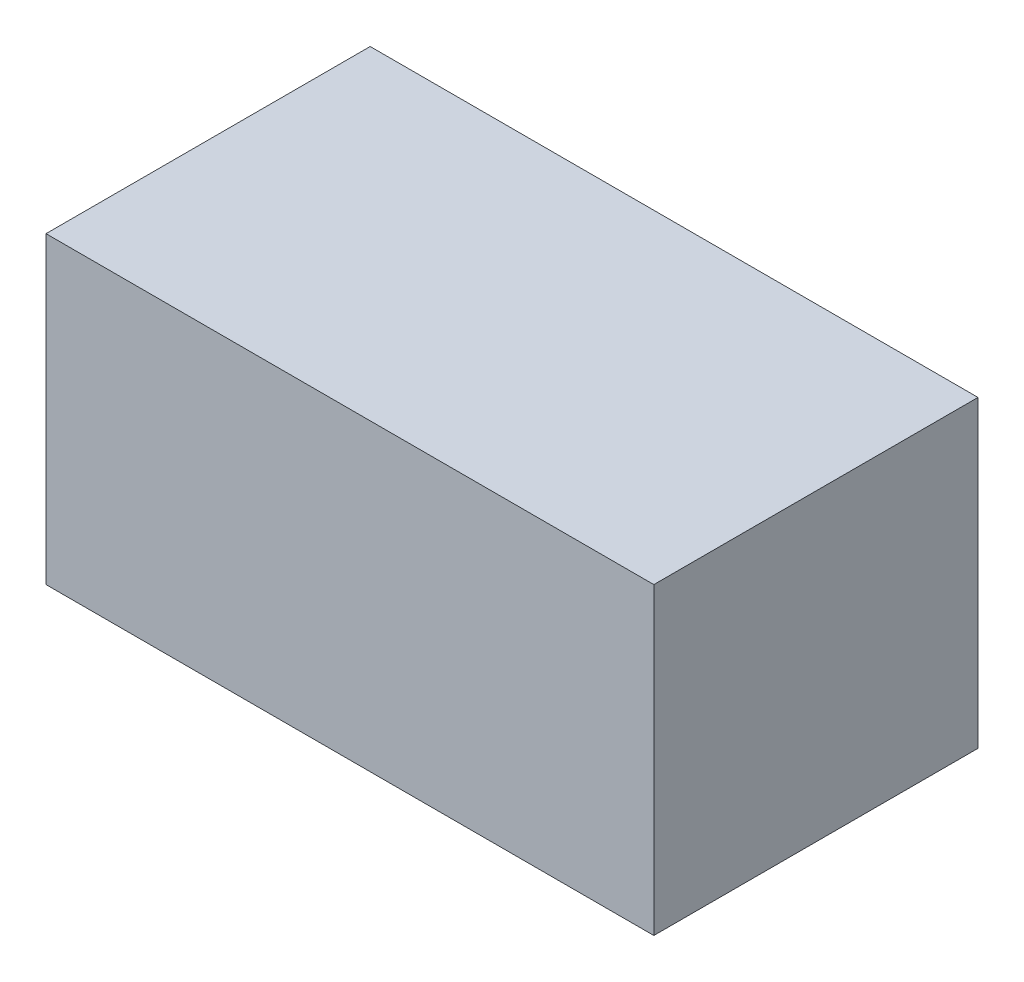
ISO-10303-21;
HEADER;
FILE_DESCRIPTION(('STEP AP214'),'2;1');
FILE_NAME('part.step','',(''),(''),'','','');
FILE_SCHEMA(('AUTOMOTIVE_DESIGN { 1 0 10303 214 1 1 1 1 }'));
ENDSEC;
DATA;
#1=APPLICATION_CONTEXT('core data for automotive mechanical design processes');
#2=APPLICATION_PROTOCOL_DEFINITION('international standard','automotive_design',2000,#1);
#3=PRODUCT_CONTEXT('',#1,'mechanical');
#4=PRODUCT('Part','Part','',(#3));
#5=PRODUCT_RELATED_PRODUCT_CATEGORY('part','',(#4));
#6=PRODUCT_DEFINITION_FORMATION('','',#4);
#7=PRODUCT_DEFINITION_CONTEXT('part definition',#1,'design');
#8=PRODUCT_DEFINITION('design','',#6,#7);
#9=PRODUCT_DEFINITION_SHAPE('','',#8);
#10=(LENGTH_UNIT() NAMED_UNIT(*) SI_UNIT(.MILLI.,.METRE.));
#11=(NAMED_UNIT(*) PLANE_ANGLE_UNIT() SI_UNIT($,.RADIAN.));
#12=(NAMED_UNIT(*) SI_UNIT($,.STERADIAN.) SOLID_ANGLE_UNIT());
#13=UNCERTAINTY_MEASURE_WITH_UNIT(LENGTH_MEASURE(1.E-05),#10,'distance_accuracy_value','');
#14=(GEOMETRIC_REPRESENTATION_CONTEXT(3) GLOBAL_UNCERTAINTY_ASSIGNED_CONTEXT((#13)) GLOBAL_UNIT_ASSIGNED_CONTEXT((#10,
#11,#12)) REPRESENTATION_CONTEXT('',''));
#15=CARTESIAN_POINT('',(0.,0.,0.));
#16=DIRECTION('',(0.,0.,1.));
#17=DIRECTION('',(1.,0.,0.));
#18=AXIS2_PLACEMENT_3D('',#15,#16,#17);
#19=CARTESIAN_POINT('',(0.,90.,0.));
#20=DIRECTION('',(-1.,0.,0.));
#21=DIRECTION('',(0.,0.,1.));
#22=AXIS2_PLACEMENT_3D('',#19,#20,#21);
#23=PLANE('',#22);
#24=DIRECTION('',(0.,0.,-1.));
#25=VECTOR('',#24,1.);
#26=CARTESIAN_POINT('',(0.,0.,0.));
#27=LINE('',#26,#25);
#28=CARTESIAN_POINT('',(0.,0.,0.));
#29=VERTEX_POINT('',#28);
#30=CARTESIAN_POINT('',(0.,0.,-96.));
#31=VERTEX_POINT('',#30);
#32=EDGE_CURVE('E74',#29,#31,#27,.T.);
#33=ORIENTED_EDGE('',*,*,#32,.T.);
#34=DIRECTION('',(0.,-1.,0.));
#35=VECTOR('',#34,1.);
#36=CARTESIAN_POINT('',(0.,90.,-96.));
#37=LINE('',#36,#35);
#38=CARTESIAN_POINT('',(0.,90.,-96.));
#39=VERTEX_POINT('',#38);
#40=EDGE_CURVE('E11',#39,#31,#37,.T.);
#41=ORIENTED_EDGE('',*,*,#40,.F.);
#42=DIRECTION('',(0.,0.,-1.));
#43=VECTOR('',#42,1.);
#44=CARTESIAN_POINT('',(0.,90.,0.));
#45=LINE('',#44,#43);
#46=CARTESIAN_POINT('',(0.,90.,0.));
#47=VERTEX_POINT('',#46);
#48=EDGE_CURVE('E92',#47,#39,#45,.T.);
#49=ORIENTED_EDGE('',*,*,#48,.F.);
#50=DIRECTION('',(0.,-1.,0.));
#51=VECTOR('',#50,1.);
#52=CARTESIAN_POINT('',(0.,90.,0.));
#53=LINE('',#52,#51);
#54=EDGE_CURVE('E86',#47,#29,#53,.T.);
#55=ORIENTED_EDGE('',*,*,#54,.T.);
#56=EDGE_LOOP('',(#33,#41,#49,#55));
#57=FACE_BOUND('',#56,.T.);
#58=ADVANCED_FACE('F30',(#57),#23,.F.);
#59=CARTESIAN_POINT('',(0.,90.,-96.));
#60=DIRECTION('',(0.,0.,1.));
#61=DIRECTION('',(1.,0.,0.));
#62=AXIS2_PLACEMENT_3D('',#59,#60,#61);
#63=PLANE('',#62);
#64=DIRECTION('',(-1.,0.,0.));
#65=VECTOR('',#64,1.);
#66=CARTESIAN_POINT('',(0.,0.,-96.));
#67=LINE('',#66,#65);
#68=CARTESIAN_POINT('',(-180.,0.,-96.));
#69=VERTEX_POINT('',#68);
#70=EDGE_CURVE('E70',#31,#69,#67,.T.);
#71=ORIENTED_EDGE('',*,*,#70,.T.);
#72=DIRECTION('',(0.,-1.,0.));
#73=VECTOR('',#72,1.);
#74=CARTESIAN_POINT('',(-180.,90.,-96.));
#75=LINE('',#74,#73);
#76=CARTESIAN_POINT('',(-180.,90.,-96.));
#77=VERTEX_POINT('',#76);
#78=EDGE_CURVE('E37',#77,#69,#75,.T.);
#79=ORIENTED_EDGE('',*,*,#78,.F.);
#80=DIRECTION('',(-1.,0.,0.));
#81=VECTOR('',#80,1.);
#82=CARTESIAN_POINT('',(0.,90.,-96.));
#83=LINE('',#82,#81);
#84=EDGE_CURVE('E82',#39,#77,#83,.T.);
#85=ORIENTED_EDGE('',*,*,#84,.F.);
#86=ORIENTED_EDGE('',*,*,#40,.T.);
#87=EDGE_LOOP('',(#71,#79,#85,#86));
#88=FACE_BOUND('',#87,.T.);
#89=ADVANCED_FACE('F81',(#88),#63,.F.);
#90=CARTESIAN_POINT('',(-180.,90.,0.));
#91=DIRECTION('',(1.,0.,0.));
#92=DIRECTION('',(0.,0.,-1.));
#93=AXIS2_PLACEMENT_3D('',#90,#91,#92);
#94=PLANE('',#93);
#95=DIRECTION('',(0.,0.,1.));
#96=VECTOR('',#95,1.);
#97=CARTESIAN_POINT('',(-180.,0.,0.));
#98=LINE('',#97,#96);
#99=CARTESIAN_POINT('',(-180.,0.,0.));
#100=VERTEX_POINT('',#99);
#101=EDGE_CURVE('E75',#69,#100,#98,.T.);
#102=ORIENTED_EDGE('',*,*,#101,.T.);
#103=DIRECTION('',(0.,-1.,0.));
#104=VECTOR('',#103,1.);
#105=CARTESIAN_POINT('',(-180.,90.,0.));
#106=LINE('',#105,#104);
#107=CARTESIAN_POINT('',(-180.,90.,0.));
#108=VERTEX_POINT('',#107);
#109=EDGE_CURVE('E98',#108,#100,#106,.T.);
#110=ORIENTED_EDGE('',*,*,#109,.F.);
#111=DIRECTION('',(0.,0.,1.));
#112=VECTOR('',#111,1.);
#113=CARTESIAN_POINT('',(-180.,90.,0.));
#114=LINE('',#113,#112);
#115=EDGE_CURVE('E49',#77,#108,#114,.T.);
#116=ORIENTED_EDGE('',*,*,#115,.F.);
#117=ORIENTED_EDGE('',*,*,#78,.T.);
#118=EDGE_LOOP('',(#102,#110,#116,#117));
#119=FACE_BOUND('',#118,.T.);
#120=ADVANCED_FACE('F101',(#119),#94,.F.);
#121=CARTESIAN_POINT('',(0.,90.,0.));
#122=DIRECTION('',(0.,0.,-1.));
#123=DIRECTION('',(-1.,0.,0.));
#124=AXIS2_PLACEMENT_3D('',#121,#122,#123);
#125=PLANE('',#124);
#126=DIRECTION('',(1.,0.,0.));
#127=VECTOR('',#126,1.);
#128=CARTESIAN_POINT('',(0.,0.,0.));
#129=LINE('',#128,#127);
#130=EDGE_CURVE('E90',#100,#29,#129,.T.);
#131=ORIENTED_EDGE('',*,*,#130,.T.);
#132=ORIENTED_EDGE('',*,*,#54,.F.);
#133=DIRECTION('',(1.,0.,0.));
#134=VECTOR('',#133,1.);
#135=CARTESIAN_POINT('',(0.,90.,0.));
#136=LINE('',#135,#134);
#137=EDGE_CURVE('E44',#108,#47,#136,.T.);
#138=ORIENTED_EDGE('',*,*,#137,.F.);
#139=ORIENTED_EDGE('',*,*,#109,.T.);
#140=EDGE_LOOP('',(#131,#132,#138,#139));
#141=FACE_BOUND('',#140,.T.);
#142=ADVANCED_FACE('F103',(#141),#125,.F.);
#143=CARTESIAN_POINT('',(0.,90.,-96.));
#144=DIRECTION('',(0.,1.,0.));
#145=DIRECTION('',(0.,0.,1.));
#146=AXIS2_PLACEMENT_3D('',#143,#144,#145);
#147=PLANE('',#146);
#148=ORIENTED_EDGE('',*,*,#48,.T.);
#149=ORIENTED_EDGE('',*,*,#84,.T.);
#150=ORIENTED_EDGE('',*,*,#115,.T.);
#151=ORIENTED_EDGE('',*,*,#137,.T.);
#152=EDGE_LOOP('',(#148,#149,#150,#151));
#153=FACE_BOUND('',#152,.T.);
#154=ADVANCED_FACE('F104',(#153),#147,.T.);
#155=CARTESIAN_POINT('',(0.,0.,-96.));
#156=DIRECTION('',(0.,1.,0.));
#157=DIRECTION('',(0.,0.,1.));
#158=AXIS2_PLACEMENT_3D('',#155,#156,#157);
#159=PLANE('',#158);
#160=ORIENTED_EDGE('',*,*,#32,.F.);
#161=ORIENTED_EDGE('',*,*,#130,.F.);
#162=ORIENTED_EDGE('',*,*,#101,.F.);
#163=ORIENTED_EDGE('',*,*,#70,.F.);
#164=EDGE_LOOP('',(#160,#161,#162,#163));
#165=FACE_BOUND('',#164,.T.);
#166=ADVANCED_FACE('F71',(#165),#159,.F.);
#167=CLOSED_SHELL('',(#58,#89,#120,#142,#154,#166));
#168=MANIFOLD_SOLID_BREP('B2',#167);
#169=ADVANCED_BREP_SHAPE_REPRESENTATION('',(#18,#168),#14);
#170=SHAPE_DEFINITION_REPRESENTATION(#9,#169);
ENDSEC;
END-ISO-10303-21;
